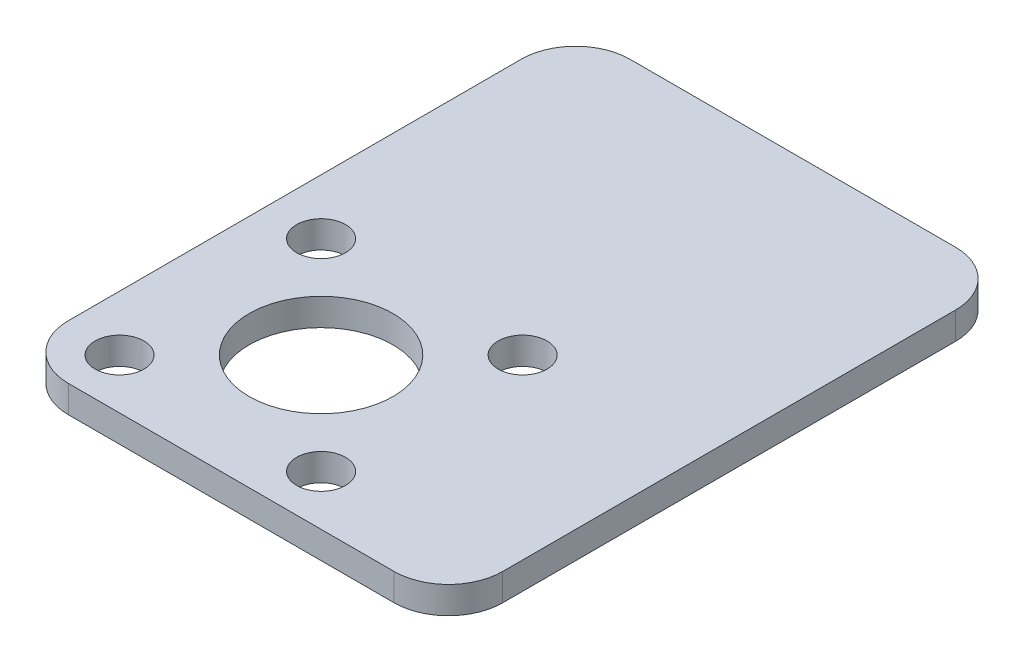
ISO-10303-21;
HEADER;
FILE_DESCRIPTION(('STEP AP214'),'2;1');
FILE_NAME('part.step','',(''),(''),'','','');
FILE_SCHEMA(('AUTOMOTIVE_DESIGN { 1 0 10303 214 1 1 1 1 }'));
ENDSEC;
DATA;
#1=APPLICATION_CONTEXT('core data for automotive mechanical design processes');
#2=APPLICATION_PROTOCOL_DEFINITION('international standard','automotive_design',2000,#1);
#3=PRODUCT_CONTEXT('',#1,'mechanical');
#4=PRODUCT('Part','Part','',(#3));
#5=PRODUCT_RELATED_PRODUCT_CATEGORY('part','',(#4));
#6=PRODUCT_DEFINITION_FORMATION('','',#4);
#7=PRODUCT_DEFINITION_CONTEXT('part definition',#1,'design');
#8=PRODUCT_DEFINITION('design','',#6,#7);
#9=PRODUCT_DEFINITION_SHAPE('','',#8);
#10=(LENGTH_UNIT() NAMED_UNIT(*) SI_UNIT(.MILLI.,.METRE.));
#11=(NAMED_UNIT(*) PLANE_ANGLE_UNIT() SI_UNIT($,.RADIAN.));
#12=(NAMED_UNIT(*) SI_UNIT($,.STERADIAN.) SOLID_ANGLE_UNIT());
#13=UNCERTAINTY_MEASURE_WITH_UNIT(LENGTH_MEASURE(1.E-05),#10,'distance_accuracy_value','');
#14=(GEOMETRIC_REPRESENTATION_CONTEXT(3) GLOBAL_UNCERTAINTY_ASSIGNED_CONTEXT((#13)) GLOBAL_UNIT_ASSIGNED_CONTEXT((#10,
#11,#12)) REPRESENTATION_CONTEXT('',''));
#15=CARTESIAN_POINT('',(0.,0.,0.));
#16=DIRECTION('',(0.,0.,1.));
#17=DIRECTION('',(1.,0.,0.));
#18=AXIS2_PLACEMENT_3D('',#15,#16,#17);
#19=CARTESIAN_POINT('',(0.,2.,0.));
#20=DIRECTION('',(0.,1.,0.));
#21=DIRECTION('',(0.,0.,1.));
#22=AXIS2_PLACEMENT_3D('',#19,#20,#21);
#23=PLANE('',#22);
#24=CARTESIAN_POINT('',(-11.9246212024587,2.,16.9896212024588));
#25=DIRECTION('',(0.,1.,0.));
#26=DIRECTION('',(-1.,0.,0.));
#27=AXIS2_PLACEMENT_3D('',#24,#25,#26);
#28=CIRCLE('',#27,1.8);
#29=CARTESIAN_POINT('',(-13.7246212024587,2.,16.9896212024588));
#30=VERTEX_POINT('',#29);
#31=EDGE_CURVE('E205',#30,#30,#28,.T.);
#32=ORIENTED_EDGE('',*,*,#31,.F.);
#33=EDGE_LOOP('',(#32));
#34=FACE_BOUND('',#33,.T.);
#35=CARTESIAN_POINT('',(-11.9246212024587,2.,2.14037879754124));
#36=DIRECTION('',(0.,1.,0.));
#37=DIRECTION('',(0.,0.,-1.));
#38=AXIS2_PLACEMENT_3D('',#35,#36,#37);
#39=CIRCLE('',#38,1.8);
#40=CARTESIAN_POINT('',(-11.9246212024587,2.,0.340378797541237));
#41=VERTEX_POINT('',#40);
#42=EDGE_CURVE('E199',#41,#41,#39,.T.);
#43=ORIENTED_EDGE('',*,*,#42,.F.);
#44=EDGE_LOOP('',(#43));
#45=FACE_BOUND('',#44,.T.);
#46=CARTESIAN_POINT('',(2.92462120245873,2.,2.14037879754124));
#47=DIRECTION('',(0.,1.,0.));
#48=DIRECTION('',(1.,0.,0.));
#49=AXIS2_PLACEMENT_3D('',#46,#47,#48);
#50=CIRCLE('',#49,1.8);
#51=CARTESIAN_POINT('',(4.72462120245873,2.,2.14037879754123));
#52=VERTEX_POINT('',#51);
#53=EDGE_CURVE('E193',#52,#52,#50,.T.);
#54=ORIENTED_EDGE('',*,*,#53,.F.);
#55=EDGE_LOOP('',(#54));
#56=FACE_BOUND('',#55,.T.);
#57=CARTESIAN_POINT('',(2.92462120245873,2.,16.9896212024588));
#58=DIRECTION('',(0.,1.,0.));
#59=DIRECTION('',(0.,0.,1.));
#60=AXIS2_PLACEMENT_3D('',#57,#58,#59);
#61=CIRCLE('',#60,1.8);
#62=CARTESIAN_POINT('',(2.92462120245873,2.,18.7896212024588));
#63=VERTEX_POINT('',#62);
#64=EDGE_CURVE('E187',#63,#63,#61,.T.);
#65=ORIENTED_EDGE('',*,*,#64,.F.);
#66=EDGE_LOOP('',(#65));
#67=FACE_BOUND('',#66,.T.);
#68=DIRECTION('',(-1.,0.,0.));
#69=VECTOR('',#68,1.);
#70=CARTESIAN_POINT('',(-16.,2.,-20.685));
#71=LINE('',#70,#69);
#72=CARTESIAN_POINT('',(12.,2.,-20.685));
#73=VERTEX_POINT('',#72);
#74=CARTESIAN_POINT('',(-12.,2.,-20.685));
#75=VERTEX_POINT('',#74);
#76=EDGE_CURVE('E169',#73,#75,#71,.T.);
#77=ORIENTED_EDGE('',*,*,#76,.T.);
#78=CARTESIAN_POINT('',(-12.,2.,-16.685));
#79=DIRECTION('',(0.,1.,0.));
#80=DIRECTION('',(0.,0.,1.));
#81=AXIS2_PLACEMENT_3D('',#78,#79,#80);
#82=CIRCLE('',#81,4.);
#83=CARTESIAN_POINT('',(-16.,2.,-16.685));
#84=VERTEX_POINT('',#83);
#85=EDGE_CURVE('E147',#75,#84,#82,.T.);
#86=ORIENTED_EDGE('',*,*,#85,.T.);
#87=DIRECTION('',(0.,0.,1.));
#88=VECTOR('',#87,1.);
#89=CARTESIAN_POINT('',(-16.,2.,-20.685));
#90=LINE('',#89,#88);
#91=CARTESIAN_POINT('',(-16.,2.,16.685));
#92=VERTEX_POINT('',#91);
#93=EDGE_CURVE('E117',#84,#92,#90,.T.);
#94=ORIENTED_EDGE('',*,*,#93,.T.);
#95=CARTESIAN_POINT('',(-12.,2.,16.685));
#96=DIRECTION('',(0.,1.,0.));
#97=DIRECTION('',(0.,0.,1.));
#98=AXIS2_PLACEMENT_3D('',#95,#96,#97);
#99=CIRCLE('',#98,4.);
#100=CARTESIAN_POINT('',(-12.,2.,20.685));
#101=VERTEX_POINT('',#100);
#102=EDGE_CURVE('E53',#92,#101,#99,.T.);
#103=ORIENTED_EDGE('',*,*,#102,.T.);
#104=DIRECTION('',(1.,0.,0.));
#105=VECTOR('',#104,1.);
#106=CARTESIAN_POINT('',(-16.,2.,20.685));
#107=LINE('',#106,#105);
#108=CARTESIAN_POINT('',(12.,2.,20.685));
#109=VERTEX_POINT('',#108);
#110=EDGE_CURVE('E133',#101,#109,#107,.T.);
#111=ORIENTED_EDGE('',*,*,#110,.T.);
#112=CARTESIAN_POINT('',(12.,2.,16.685));
#113=DIRECTION('',(0.,1.,0.));
#114=DIRECTION('',(0.,0.,1.));
#115=AXIS2_PLACEMENT_3D('',#112,#113,#114);
#116=CIRCLE('',#115,4.);
#117=CARTESIAN_POINT('',(16.,2.,16.685));
#118=VERTEX_POINT('',#117);
#119=EDGE_CURVE('E143',#109,#118,#116,.T.);
#120=ORIENTED_EDGE('',*,*,#119,.T.);
#121=DIRECTION('',(0.,0.,-1.));
#122=VECTOR('',#121,1.);
#123=CARTESIAN_POINT('',(16.,2.,-20.685));
#124=LINE('',#123,#122);
#125=CARTESIAN_POINT('',(16.,2.,-16.685));
#126=VERTEX_POINT('',#125);
#127=EDGE_CURVE('E127',#118,#126,#124,.T.);
#128=ORIENTED_EDGE('',*,*,#127,.T.);
#129=CARTESIAN_POINT('',(12.,2.,-16.685));
#130=DIRECTION('',(0.,1.,0.));
#131=DIRECTION('',(0.,0.,1.));
#132=AXIS2_PLACEMENT_3D('',#129,#130,#131);
#133=CIRCLE('',#132,4.);
#134=EDGE_CURVE('E145',#126,#73,#133,.T.);
#135=ORIENTED_EDGE('',*,*,#134,.T.);
#136=EDGE_LOOP('',(#77,#86,#94,#103,#111,#120,#128,#135));
#137=FACE_BOUND('',#136,.T.);
#138=CARTESIAN_POINT('',(-4.5,2.,9.565));
#139=DIRECTION('',(0.,1.,0.));
#140=DIRECTION('',(0.,0.,1.));
#141=AXIS2_PLACEMENT_3D('',#138,#139,#140);
#142=CIRCLE('',#141,5.3);
#143=CARTESIAN_POINT('',(-4.5,2.,14.865));
#144=VERTEX_POINT('',#143);
#145=EDGE_CURVE('E178',#144,#144,#142,.T.);
#146=ORIENTED_EDGE('',*,*,#145,.F.);
#147=EDGE_LOOP('',(#146));
#148=FACE_BOUND('',#147,.T.);
#149=ADVANCED_FACE('F33',(#34,#45,#56,#67,#137,#148),#23,.T.);
#150=CARTESIAN_POINT('',(0.,0.,0.));
#151=DIRECTION('',(0.,1.,0.));
#152=DIRECTION('',(0.,0.,1.));
#153=AXIS2_PLACEMENT_3D('',#150,#151,#152);
#154=PLANE('',#153);
#155=CARTESIAN_POINT('',(-11.9246212024587,0.,16.9896212024588));
#156=DIRECTION('',(0.,1.,0.));
#157=DIRECTION('',(0.,0.,1.));
#158=AXIS2_PLACEMENT_3D('',#155,#156,#157);
#159=CIRCLE('',#158,1.8);
#160=CARTESIAN_POINT('',(-11.9246212024587,0.,18.7896212024588));
#161=VERTEX_POINT('',#160);
#162=EDGE_CURVE('E202',#161,#161,#159,.F.);
#163=ORIENTED_EDGE('',*,*,#162,.F.);
#164=EDGE_LOOP('',(#163));
#165=FACE_BOUND('',#164,.T.);
#166=CARTESIAN_POINT('',(-11.9246212024587,0.,2.14037879754124));
#167=DIRECTION('',(0.,1.,0.));
#168=DIRECTION('',(0.,0.,1.));
#169=AXIS2_PLACEMENT_3D('',#166,#167,#168);
#170=CIRCLE('',#169,1.8);
#171=CARTESIAN_POINT('',(-11.9246212024587,0.,3.94037879754124));
#172=VERTEX_POINT('',#171);
#173=EDGE_CURVE('E196',#172,#172,#170,.F.);
#174=ORIENTED_EDGE('',*,*,#173,.F.);
#175=EDGE_LOOP('',(#174));
#176=FACE_BOUND('',#175,.T.);
#177=CARTESIAN_POINT('',(2.92462120245873,0.,2.14037879754124));
#178=DIRECTION('',(0.,1.,0.));
#179=DIRECTION('',(0.,0.,1.));
#180=AXIS2_PLACEMENT_3D('',#177,#178,#179);
#181=CIRCLE('',#180,1.8);
#182=CARTESIAN_POINT('',(2.92462120245873,0.,3.94037879754124));
#183=VERTEX_POINT('',#182);
#184=EDGE_CURVE('E190',#183,#183,#181,.F.);
#185=ORIENTED_EDGE('',*,*,#184,.F.);
#186=EDGE_LOOP('',(#185));
#187=FACE_BOUND('',#186,.T.);
#188=CARTESIAN_POINT('',(2.92462120245873,0.,16.9896212024588));
#189=DIRECTION('',(0.,1.,0.));
#190=DIRECTION('',(0.,0.,1.));
#191=AXIS2_PLACEMENT_3D('',#188,#189,#190);
#192=CIRCLE('',#191,1.8);
#193=CARTESIAN_POINT('',(2.92462120245873,0.,18.7896212024588));
#194=VERTEX_POINT('',#193);
#195=EDGE_CURVE('E183',#194,#194,#192,.F.);
#196=ORIENTED_EDGE('',*,*,#195,.F.);
#197=EDGE_LOOP('',(#196));
#198=FACE_BOUND('',#197,.T.);
#199=DIRECTION('',(0.,0.,1.));
#200=VECTOR('',#199,1.);
#201=CARTESIAN_POINT('',(-16.,0.,-20.685));
#202=LINE('',#201,#200);
#203=CARTESIAN_POINT('',(-16.,0.,-16.685));
#204=VERTEX_POINT('',#203);
#205=CARTESIAN_POINT('',(-16.,0.,16.685));
#206=VERTEX_POINT('',#205);
#207=EDGE_CURVE('E115',#204,#206,#202,.T.);
#208=ORIENTED_EDGE('',*,*,#207,.F.);
#209=CARTESIAN_POINT('',(-12.,0.,-16.685));
#210=DIRECTION('',(0.,1.,0.));
#211=DIRECTION('',(0.,0.,1.));
#212=AXIS2_PLACEMENT_3D('',#209,#210,#211);
#213=CIRCLE('',#212,4.);
#214=CARTESIAN_POINT('',(-12.,0.,-20.685));
#215=VERTEX_POINT('',#214);
#216=EDGE_CURVE('E98',#204,#215,#213,.F.);
#217=ORIENTED_EDGE('',*,*,#216,.T.);
#218=DIRECTION('',(-1.,0.,0.));
#219=VECTOR('',#218,1.);
#220=CARTESIAN_POINT('',(-16.,0.,-20.685));
#221=LINE('',#220,#219);
#222=CARTESIAN_POINT('',(12.,0.,-20.685));
#223=VERTEX_POINT('',#222);
#224=EDGE_CURVE('E125',#223,#215,#221,.T.);
#225=ORIENTED_EDGE('',*,*,#224,.F.);
#226=CARTESIAN_POINT('',(12.,0.,-16.685));
#227=DIRECTION('',(0.,1.,0.));
#228=DIRECTION('',(0.,0.,1.));
#229=AXIS2_PLACEMENT_3D('',#226,#227,#228);
#230=CIRCLE('',#229,4.);
#231=CARTESIAN_POINT('',(16.,0.,-16.685));
#232=VERTEX_POINT('',#231);
#233=EDGE_CURVE('E109',#223,#232,#230,.F.);
#234=ORIENTED_EDGE('',*,*,#233,.T.);
#235=DIRECTION('',(0.,0.,-1.));
#236=VECTOR('',#235,1.);
#237=CARTESIAN_POINT('',(16.,0.,-20.685));
#238=LINE('',#237,#236);
#239=CARTESIAN_POINT('',(16.,0.,16.685));
#240=VERTEX_POINT('',#239);
#241=EDGE_CURVE('E129',#240,#232,#238,.T.);
#242=ORIENTED_EDGE('',*,*,#241,.F.);
#243=CARTESIAN_POINT('',(12.,0.,16.685));
#244=DIRECTION('',(0.,1.,0.));
#245=DIRECTION('',(0.,0.,1.));
#246=AXIS2_PLACEMENT_3D('',#243,#244,#245);
#247=CIRCLE('',#246,4.);
#248=CARTESIAN_POINT('',(12.,0.,20.685));
#249=VERTEX_POINT('',#248);
#250=EDGE_CURVE('E136',#240,#249,#247,.F.);
#251=ORIENTED_EDGE('',*,*,#250,.T.);
#252=DIRECTION('',(1.,0.,0.));
#253=VECTOR('',#252,1.);
#254=CARTESIAN_POINT('',(-16.,0.,20.685));
#255=LINE('',#254,#253);
#256=CARTESIAN_POINT('',(-12.,0.,20.685));
#257=VERTEX_POINT('',#256);
#258=EDGE_CURVE('E124',#257,#249,#255,.T.);
#259=ORIENTED_EDGE('',*,*,#258,.F.);
#260=CARTESIAN_POINT('',(-12.,0.,16.685));
#261=DIRECTION('',(0.,1.,0.));
#262=DIRECTION('',(0.,0.,1.));
#263=AXIS2_PLACEMENT_3D('',#260,#261,#262);
#264=CIRCLE('',#263,4.);
#265=EDGE_CURVE('E118',#257,#206,#264,.F.);
#266=ORIENTED_EDGE('',*,*,#265,.T.);
#267=EDGE_LOOP('',(#208,#217,#225,#234,#242,#251,#259,#266));
#268=FACE_BOUND('',#267,.T.);
#269=CARTESIAN_POINT('',(-4.5,0.,9.565));
#270=DIRECTION('',(0.,1.,0.));
#271=DIRECTION('',(0.,0.,1.));
#272=AXIS2_PLACEMENT_3D('',#269,#270,#271);
#273=CIRCLE('',#272,5.3);
#274=CARTESIAN_POINT('',(-4.5,0.,14.865));
#275=VERTEX_POINT('',#274);
#276=EDGE_CURVE('E174',#275,#275,#273,.T.);
#277=ORIENTED_EDGE('',*,*,#276,.T.);
#278=EDGE_LOOP('',(#277));
#279=FACE_BOUND('',#278,.T.);
#280=ADVANCED_FACE('F121',(#165,#176,#187,#198,#268,#279),#154,.F.);
#281=CARTESIAN_POINT('',(16.,2.,-20.685));
#282=DIRECTION('',(-1.,0.,0.));
#283=DIRECTION('',(0.,0.,1.));
#284=AXIS2_PLACEMENT_3D('',#281,#282,#283);
#285=PLANE('',#284);
#286=ORIENTED_EDGE('',*,*,#241,.T.);
#287=DIRECTION('',(0.,-1.,0.));
#288=VECTOR('',#287,1.);
#289=CARTESIAN_POINT('',(16.,2.,-16.685));
#290=LINE('',#289,#288);
#291=EDGE_CURVE('E152',#232,#126,#290,.F.);
#292=ORIENTED_EDGE('',*,*,#291,.T.);
#293=ORIENTED_EDGE('',*,*,#127,.F.);
#294=DIRECTION('',(0.,-1.,0.));
#295=VECTOR('',#294,1.);
#296=CARTESIAN_POINT('',(16.,2.,16.685));
#297=LINE('',#296,#295);
#298=EDGE_CURVE('E149',#118,#240,#297,.T.);
#299=ORIENTED_EDGE('',*,*,#298,.T.);
#300=EDGE_LOOP('',(#286,#292,#293,#299));
#301=FACE_BOUND('',#300,.T.);
#302=ADVANCED_FACE('F165',(#301),#285,.F.);
#303=CARTESIAN_POINT('',(-16.,2.,-20.685));
#304=DIRECTION('',(0.,0.,1.));
#305=DIRECTION('',(1.,0.,0.));
#306=AXIS2_PLACEMENT_3D('',#303,#304,#305);
#307=PLANE('',#306);
#308=ORIENTED_EDGE('',*,*,#224,.T.);
#309=DIRECTION('',(0.,-1.,0.));
#310=VECTOR('',#309,1.);
#311=CARTESIAN_POINT('',(-12.,2.,-20.685));
#312=LINE('',#311,#310);
#313=EDGE_CURVE('E103',#215,#75,#312,.F.);
#314=ORIENTED_EDGE('',*,*,#313,.T.);
#315=ORIENTED_EDGE('',*,*,#76,.F.);
#316=DIRECTION('',(0.,-1.,0.));
#317=VECTOR('',#316,1.);
#318=CARTESIAN_POINT('',(12.,2.,-20.685));
#319=LINE('',#318,#317);
#320=EDGE_CURVE('E108',#73,#223,#319,.T.);
#321=ORIENTED_EDGE('',*,*,#320,.T.);
#322=EDGE_LOOP('',(#308,#314,#315,#321));
#323=FACE_BOUND('',#322,.T.);
#324=ADVANCED_FACE('F224',(#323),#307,.F.);
#325=CARTESIAN_POINT('',(-16.,2.,-20.685));
#326=DIRECTION('',(1.,0.,0.));
#327=DIRECTION('',(0.,0.,-1.));
#328=AXIS2_PLACEMENT_3D('',#325,#326,#327);
#329=PLANE('',#328);
#330=ORIENTED_EDGE('',*,*,#93,.F.);
#331=DIRECTION('',(0.,-1.,0.));
#332=VECTOR('',#331,1.);
#333=CARTESIAN_POINT('',(-16.,2.,-16.685));
#334=LINE('',#333,#332);
#335=EDGE_CURVE('E102',#84,#204,#334,.T.);
#336=ORIENTED_EDGE('',*,*,#335,.T.);
#337=ORIENTED_EDGE('',*,*,#207,.T.);
#338=DIRECTION('',(0.,-1.,0.));
#339=VECTOR('',#338,1.);
#340=CARTESIAN_POINT('',(-16.,2.,16.685));
#341=LINE('',#340,#339);
#342=EDGE_CURVE('E119',#206,#92,#341,.F.);
#343=ORIENTED_EDGE('',*,*,#342,.T.);
#344=EDGE_LOOP('',(#330,#336,#337,#343));
#345=FACE_BOUND('',#344,.T.);
#346=ADVANCED_FACE('F114',(#345),#329,.F.);
#347=CARTESIAN_POINT('',(-16.,2.,20.685));
#348=DIRECTION('',(0.,0.,-1.));
#349=DIRECTION('',(-1.,0.,0.));
#350=AXIS2_PLACEMENT_3D('',#347,#348,#349);
#351=PLANE('',#350);
#352=ORIENTED_EDGE('',*,*,#258,.T.);
#353=DIRECTION('',(0.,-1.,0.));
#354=VECTOR('',#353,1.);
#355=CARTESIAN_POINT('',(12.,2.,20.685));
#356=LINE('',#355,#354);
#357=EDGE_CURVE('E11',#249,#109,#356,.F.);
#358=ORIENTED_EDGE('',*,*,#357,.T.);
#359=ORIENTED_EDGE('',*,*,#110,.F.);
#360=DIRECTION('',(0.,-1.,0.));
#361=VECTOR('',#360,1.);
#362=CARTESIAN_POINT('',(-12.,2.,20.685));
#363=LINE('',#362,#361);
#364=EDGE_CURVE('E41',#101,#257,#363,.T.);
#365=ORIENTED_EDGE('',*,*,#364,.T.);
#366=EDGE_LOOP('',(#352,#358,#359,#365));
#367=FACE_BOUND('',#366,.T.);
#368=ADVANCED_FACE('F155',(#367),#351,.F.);
#369=CARTESIAN_POINT('',(-4.5,2.,9.565));
#370=DIRECTION('',(0.,-1.,0.));
#371=DIRECTION('',(0.,0.,-1.));
#372=AXIS2_PLACEMENT_3D('',#369,#370,#371);
#373=CYLINDRICAL_SURFACE('',#372,5.3);
#374=ORIENTED_EDGE('',*,*,#145,.T.);
#375=EDGE_LOOP('',(#374));
#376=FACE_BOUND('',#375,.T.);
#377=ORIENTED_EDGE('',*,*,#276,.F.);
#378=EDGE_LOOP('',(#377));
#379=FACE_BOUND('',#378,.T.);
#380=ADVANCED_FACE('F243',(#376,#379),#373,.F.);
#381=CARTESIAN_POINT('',(2.92462120245873,-0.00100000000000013,16.9896212024588));
#382=DIRECTION('',(0.,1.,0.));
#383=DIRECTION('',(0.,0.,1.));
#384=AXIS2_PLACEMENT_3D('',#381,#382,#383);
#385=CYLINDRICAL_SURFACE('',#384,1.8);
#386=ORIENTED_EDGE('',*,*,#64,.T.);
#387=EDGE_LOOP('',(#386));
#388=FACE_BOUND('',#387,.T.);
#389=ORIENTED_EDGE('',*,*,#195,.T.);
#390=EDGE_LOOP('',(#389));
#391=FACE_BOUND('',#390,.T.);
#392=ADVANCED_FACE('F249',(#388,#391),#385,.F.);
#393=CARTESIAN_POINT('',(2.92462120245873,-0.00100000000000013,2.14037879754124));
#394=DIRECTION('',(0.,1.,0.));
#395=DIRECTION('',(0.,0.,1.));
#396=AXIS2_PLACEMENT_3D('',#393,#394,#395);
#397=CYLINDRICAL_SURFACE('',#396,1.8);
#398=ORIENTED_EDGE('',*,*,#53,.T.);
#399=EDGE_LOOP('',(#398));
#400=FACE_BOUND('',#399,.T.);
#401=ORIENTED_EDGE('',*,*,#184,.T.);
#402=EDGE_LOOP('',(#401));
#403=FACE_BOUND('',#402,.T.);
#404=ADVANCED_FACE('F252',(#400,#403),#397,.F.);
#405=CARTESIAN_POINT('',(-11.9246212024587,-0.00100000000000013,2.14037879754124));
#406=DIRECTION('',(0.,1.,0.));
#407=DIRECTION('',(0.,0.,1.));
#408=AXIS2_PLACEMENT_3D('',#405,#406,#407);
#409=CYLINDRICAL_SURFACE('',#408,1.8);
#410=ORIENTED_EDGE('',*,*,#42,.T.);
#411=EDGE_LOOP('',(#410));
#412=FACE_BOUND('',#411,.T.);
#413=ORIENTED_EDGE('',*,*,#173,.T.);
#414=EDGE_LOOP('',(#413));
#415=FACE_BOUND('',#414,.T.);
#416=ADVANCED_FACE('F256',(#412,#415),#409,.F.);
#417=CARTESIAN_POINT('',(-11.9246212024587,-0.00100000000000013,16.9896212024588));
#418=DIRECTION('',(0.,1.,0.));
#419=DIRECTION('',(0.,0.,1.));
#420=AXIS2_PLACEMENT_3D('',#417,#418,#419);
#421=CYLINDRICAL_SURFACE('',#420,1.8);
#422=ORIENTED_EDGE('',*,*,#31,.T.);
#423=EDGE_LOOP('',(#422));
#424=FACE_BOUND('',#423,.T.);
#425=ORIENTED_EDGE('',*,*,#162,.T.);
#426=EDGE_LOOP('',(#425));
#427=FACE_BOUND('',#426,.T.);
#428=ADVANCED_FACE('F209',(#424,#427),#421,.F.);
#429=CARTESIAN_POINT('',(-12.,2.,-16.685));
#430=DIRECTION('',(0.,-1.,0.));
#431=DIRECTION('',(0.,0.,-1.));
#432=AXIS2_PLACEMENT_3D('',#429,#430,#431);
#433=CYLINDRICAL_SURFACE('',#432,4.);
#434=ORIENTED_EDGE('',*,*,#85,.F.);
#435=ORIENTED_EDGE('',*,*,#313,.F.);
#436=ORIENTED_EDGE('',*,*,#216,.F.);
#437=ORIENTED_EDGE('',*,*,#335,.F.);
#438=EDGE_LOOP('',(#434,#435,#436,#437));
#439=FACE_BOUND('',#438,.T.);
#440=ADVANCED_FACE('F101',(#439),#433,.T.);
#441=CARTESIAN_POINT('',(12.,2.,-16.685));
#442=DIRECTION('',(0.,-1.,0.));
#443=DIRECTION('',(0.,0.,-1.));
#444=AXIS2_PLACEMENT_3D('',#441,#442,#443);
#445=CYLINDRICAL_SURFACE('',#444,4.);
#446=ORIENTED_EDGE('',*,*,#134,.F.);
#447=ORIENTED_EDGE('',*,*,#291,.F.);
#448=ORIENTED_EDGE('',*,*,#233,.F.);
#449=ORIENTED_EDGE('',*,*,#320,.F.);
#450=EDGE_LOOP('',(#446,#447,#448,#449));
#451=FACE_BOUND('',#450,.T.);
#452=ADVANCED_FACE('F226',(#451),#445,.T.);
#453=CARTESIAN_POINT('',(12.,2.,16.685));
#454=DIRECTION('',(0.,-1.,0.));
#455=DIRECTION('',(0.,0.,-1.));
#456=AXIS2_PLACEMENT_3D('',#453,#454,#455);
#457=CYLINDRICAL_SURFACE('',#456,4.);
#458=ORIENTED_EDGE('',*,*,#119,.F.);
#459=ORIENTED_EDGE('',*,*,#357,.F.);
#460=ORIENTED_EDGE('',*,*,#250,.F.);
#461=ORIENTED_EDGE('',*,*,#298,.F.);
#462=EDGE_LOOP('',(#458,#459,#460,#461));
#463=FACE_BOUND('',#462,.T.);
#464=ADVANCED_FACE('F162',(#463),#457,.T.);
#465=CARTESIAN_POINT('',(-12.,2.,16.685));
#466=DIRECTION('',(0.,-1.,0.));
#467=DIRECTION('',(0.,0.,-1.));
#468=AXIS2_PLACEMENT_3D('',#465,#466,#467);
#469=CYLINDRICAL_SURFACE('',#468,4.);
#470=ORIENTED_EDGE('',*,*,#102,.F.);
#471=ORIENTED_EDGE('',*,*,#342,.F.);
#472=ORIENTED_EDGE('',*,*,#265,.F.);
#473=ORIENTED_EDGE('',*,*,#364,.F.);
#474=EDGE_LOOP('',(#470,#471,#472,#473));
#475=FACE_BOUND('',#474,.T.);
#476=ADVANCED_FACE('F35',(#475),#469,.T.);
#477=CLOSED_SHELL('',(#149,#280,#302,#324,#346,#368,#380,#392,#404,#416,#428,#440,#452,#464,#476));
#478=MANIFOLD_SOLID_BREP('B2',#477);
#479=ADVANCED_BREP_SHAPE_REPRESENTATION('',(#18,#478),#14);
#480=SHAPE_DEFINITION_REPRESENTATION(#9,#479);
ENDSEC;
END-ISO-10303-21;
